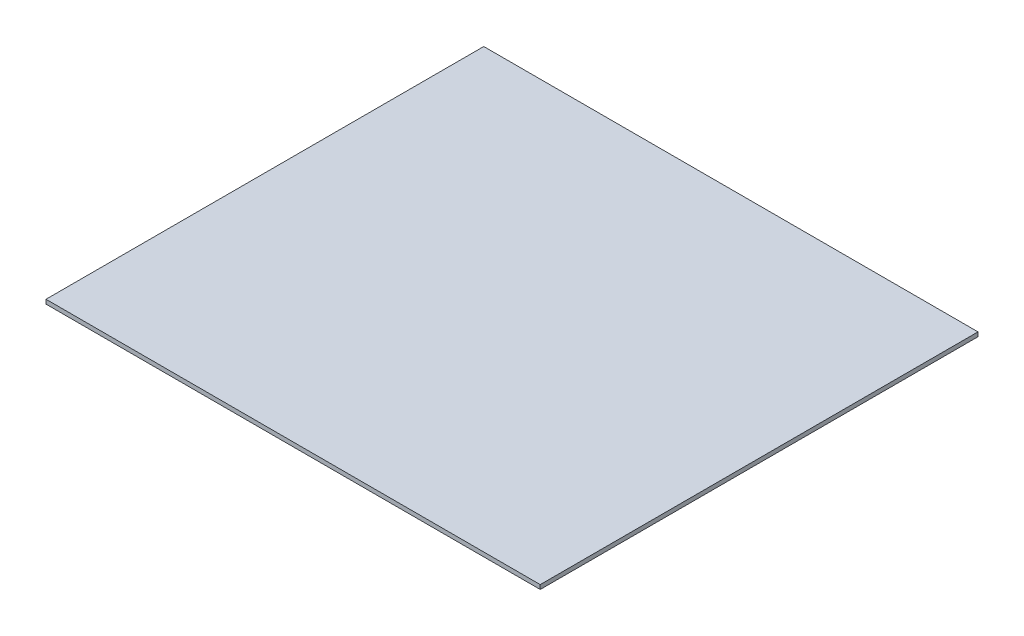
ISO-10303-21;
HEADER;
FILE_DESCRIPTION(('STEP AP214'),'2;1');
FILE_NAME('part.step','',(''),(''),'','','');
FILE_SCHEMA(('AUTOMOTIVE_DESIGN { 1 0 10303 214 1 1 1 1 }'));
ENDSEC;
DATA;
#1=APPLICATION_CONTEXT('core data for automotive mechanical design processes');
#2=APPLICATION_PROTOCOL_DEFINITION('international standard','automotive_design',2000,#1);
#3=PRODUCT_CONTEXT('',#1,'mechanical');
#4=PRODUCT('Part','Part','',(#3));
#5=PRODUCT_RELATED_PRODUCT_CATEGORY('part','',(#4));
#6=PRODUCT_DEFINITION_FORMATION('','',#4);
#7=PRODUCT_DEFINITION_CONTEXT('part definition',#1,'design');
#8=PRODUCT_DEFINITION('design','',#6,#7);
#9=PRODUCT_DEFINITION_SHAPE('','',#8);
#10=(LENGTH_UNIT() NAMED_UNIT(*) SI_UNIT(.MILLI.,.METRE.));
#11=(NAMED_UNIT(*) PLANE_ANGLE_UNIT() SI_UNIT($,.RADIAN.));
#12=(NAMED_UNIT(*) SI_UNIT($,.STERADIAN.) SOLID_ANGLE_UNIT());
#13=UNCERTAINTY_MEASURE_WITH_UNIT(LENGTH_MEASURE(1.E-05),#10,'distance_accuracy_value','');
#14=(GEOMETRIC_REPRESENTATION_CONTEXT(3) GLOBAL_UNCERTAINTY_ASSIGNED_CONTEXT((#13)) GLOBAL_UNIT_ASSIGNED_CONTEXT((#10,
#11,#12)) REPRESENTATION_CONTEXT('',''));
#15=CARTESIAN_POINT('',(0.,0.,0.));
#16=DIRECTION('',(0.,0.,1.));
#17=DIRECTION('',(1.,0.,0.));
#18=AXIS2_PLACEMENT_3D('',#15,#16,#17);
#19=CARTESIAN_POINT('',(175.,3.,155.));
#20=DIRECTION('',(-1.,0.,0.));
#21=DIRECTION('',(0.,0.,1.));
#22=AXIS2_PLACEMENT_3D('',#19,#20,#21);
#23=PLANE('',#22);
#24=DIRECTION('',(0.,0.,-1.));
#25=VECTOR('',#24,1.);
#26=CARTESIAN_POINT('',(175.,0.,155.));
#27=LINE('',#26,#25);
#28=CARTESIAN_POINT('',(175.,0.,155.));
#29=VERTEX_POINT('',#28);
#30=CARTESIAN_POINT('',(175.,0.,-155.));
#31=VERTEX_POINT('',#30);
#32=EDGE_CURVE('E96',#29,#31,#27,.T.);
#33=ORIENTED_EDGE('',*,*,#32,.T.);
#34=DIRECTION('',(0.,-1.,0.));
#35=VECTOR('',#34,1.);
#36=CARTESIAN_POINT('',(175.,3.,-155.));
#37=LINE('',#36,#35);
#38=CARTESIAN_POINT('',(175.,3.,-155.));
#39=VERTEX_POINT('',#38);
#40=EDGE_CURVE('E11',#39,#31,#37,.T.);
#41=ORIENTED_EDGE('',*,*,#40,.F.);
#42=DIRECTION('',(0.,0.,-1.));
#43=VECTOR('',#42,1.);
#44=CARTESIAN_POINT('',(175.,3.,155.));
#45=LINE('',#44,#43);
#46=CARTESIAN_POINT('',(175.,3.,155.));
#47=VERTEX_POINT('',#46);
#48=EDGE_CURVE('E84',#47,#39,#45,.T.);
#49=ORIENTED_EDGE('',*,*,#48,.F.);
#50=DIRECTION('',(0.,-1.,0.));
#51=VECTOR('',#50,1.);
#52=CARTESIAN_POINT('',(175.,3.,155.));
#53=LINE('',#52,#51);
#54=EDGE_CURVE('E92',#47,#29,#53,.T.);
#55=ORIENTED_EDGE('',*,*,#54,.T.);
#56=EDGE_LOOP('',(#33,#41,#49,#55));
#57=FACE_BOUND('',#56,.T.);
#58=ADVANCED_FACE('F33',(#57),#23,.F.);
#59=CARTESIAN_POINT('',(-175.,3.,-155.));
#60=DIRECTION('',(0.,0.,1.));
#61=DIRECTION('',(1.,0.,0.));
#62=AXIS2_PLACEMENT_3D('',#59,#60,#61);
#63=PLANE('',#62);
#64=DIRECTION('',(-1.,0.,0.));
#65=VECTOR('',#64,1.);
#66=CARTESIAN_POINT('',(-175.,0.,-155.));
#67=LINE('',#66,#65);
#68=CARTESIAN_POINT('',(-175.,0.,-155.));
#69=VERTEX_POINT('',#68);
#70=EDGE_CURVE('E88',#31,#69,#67,.T.);
#71=ORIENTED_EDGE('',*,*,#70,.T.);
#72=DIRECTION('',(0.,-1.,0.));
#73=VECTOR('',#72,1.);
#74=CARTESIAN_POINT('',(-175.,3.,-155.));
#75=LINE('',#74,#73);
#76=CARTESIAN_POINT('',(-175.,3.,-155.));
#77=VERTEX_POINT('',#76);
#78=EDGE_CURVE('E41',#77,#69,#75,.T.);
#79=ORIENTED_EDGE('',*,*,#78,.F.);
#80=DIRECTION('',(-1.,0.,0.));
#81=VECTOR('',#80,1.);
#82=CARTESIAN_POINT('',(-175.,3.,-155.));
#83=LINE('',#82,#81);
#84=EDGE_CURVE('E79',#39,#77,#83,.T.);
#85=ORIENTED_EDGE('',*,*,#84,.F.);
#86=ORIENTED_EDGE('',*,*,#40,.T.);
#87=EDGE_LOOP('',(#71,#79,#85,#86));
#88=FACE_BOUND('',#87,.T.);
#89=ADVANCED_FACE('F87',(#88),#63,.F.);
#90=CARTESIAN_POINT('',(-175.,3.,155.));
#91=DIRECTION('',(1.,0.,0.));
#92=DIRECTION('',(0.,0.,-1.));
#93=AXIS2_PLACEMENT_3D('',#90,#91,#92);
#94=PLANE('',#93);
#95=DIRECTION('',(0.,0.,1.));
#96=VECTOR('',#95,1.);
#97=CARTESIAN_POINT('',(-175.,0.,155.));
#98=LINE('',#97,#96);
#99=CARTESIAN_POINT('',(-175.,0.,155.));
#100=VERTEX_POINT('',#99);
#101=EDGE_CURVE('E66',#69,#100,#98,.T.);
#102=ORIENTED_EDGE('',*,*,#101,.T.);
#103=DIRECTION('',(0.,-1.,0.));
#104=VECTOR('',#103,1.);
#105=CARTESIAN_POINT('',(-175.,3.,155.));
#106=LINE('',#105,#104);
#107=CARTESIAN_POINT('',(-175.,3.,155.));
#108=VERTEX_POINT('',#107);
#109=EDGE_CURVE('E89',#108,#100,#106,.T.);
#110=ORIENTED_EDGE('',*,*,#109,.F.);
#111=DIRECTION('',(0.,0.,1.));
#112=VECTOR('',#111,1.);
#113=CARTESIAN_POINT('',(-175.,3.,155.));
#114=LINE('',#113,#112);
#115=EDGE_CURVE('E82',#77,#108,#114,.T.);
#116=ORIENTED_EDGE('',*,*,#115,.F.);
#117=ORIENTED_EDGE('',*,*,#78,.T.);
#118=EDGE_LOOP('',(#102,#110,#116,#117));
#119=FACE_BOUND('',#118,.T.);
#120=ADVANCED_FACE('F90',(#119),#94,.F.);
#121=CARTESIAN_POINT('',(-175.,3.,155.));
#122=DIRECTION('',(0.,0.,-1.));
#123=DIRECTION('',(-1.,0.,0.));
#124=AXIS2_PLACEMENT_3D('',#121,#122,#123);
#125=PLANE('',#124);
#126=DIRECTION('',(1.,0.,0.));
#127=VECTOR('',#126,1.);
#128=CARTESIAN_POINT('',(-175.,0.,155.));
#129=LINE('',#128,#127);
#130=EDGE_CURVE('E72',#100,#29,#129,.T.);
#131=ORIENTED_EDGE('',*,*,#130,.T.);
#132=ORIENTED_EDGE('',*,*,#54,.F.);
#133=DIRECTION('',(1.,0.,0.));
#134=VECTOR('',#133,1.);
#135=CARTESIAN_POINT('',(-175.,3.,155.));
#136=LINE('',#135,#134);
#137=EDGE_CURVE('E49',#108,#47,#136,.T.);
#138=ORIENTED_EDGE('',*,*,#137,.F.);
#139=ORIENTED_EDGE('',*,*,#109,.T.);
#140=EDGE_LOOP('',(#131,#132,#138,#139));
#141=FACE_BOUND('',#140,.T.);
#142=ADVANCED_FACE('F103',(#141),#125,.F.);
#143=CARTESIAN_POINT('',(0.,3.,0.));
#144=DIRECTION('',(0.,-1.,0.));
#145=DIRECTION('',(0.,0.,-1.));
#146=AXIS2_PLACEMENT_3D('',#143,#144,#145);
#147=PLANE('',#146);
#148=ORIENTED_EDGE('',*,*,#48,.T.);
#149=ORIENTED_EDGE('',*,*,#84,.T.);
#150=ORIENTED_EDGE('',*,*,#115,.T.);
#151=ORIENTED_EDGE('',*,*,#137,.T.);
#152=EDGE_LOOP('',(#148,#149,#150,#151));
#153=FACE_BOUND('',#152,.T.);
#154=ADVANCED_FACE('F80',(#153),#147,.F.);
#155=CARTESIAN_POINT('',(0.,0.,0.));
#156=DIRECTION('',(0.,-1.,0.));
#157=DIRECTION('',(0.,0.,-1.));
#158=AXIS2_PLACEMENT_3D('',#155,#156,#157);
#159=PLANE('',#158);
#160=ORIENTED_EDGE('',*,*,#32,.F.);
#161=ORIENTED_EDGE('',*,*,#130,.F.);
#162=ORIENTED_EDGE('',*,*,#101,.F.);
#163=ORIENTED_EDGE('',*,*,#70,.F.);
#164=EDGE_LOOP('',(#160,#161,#162,#163));
#165=FACE_BOUND('',#164,.T.);
#166=ADVANCED_FACE('F106',(#165),#159,.T.);
#167=CLOSED_SHELL('',(#58,#89,#120,#142,#154,#166));
#168=MANIFOLD_SOLID_BREP('B2',#167);
#169=ADVANCED_BREP_SHAPE_REPRESENTATION('',(#18,#168),#14);
#170=SHAPE_DEFINITION_REPRESENTATION(#9,#169);
ENDSEC;
END-ISO-10303-21;
